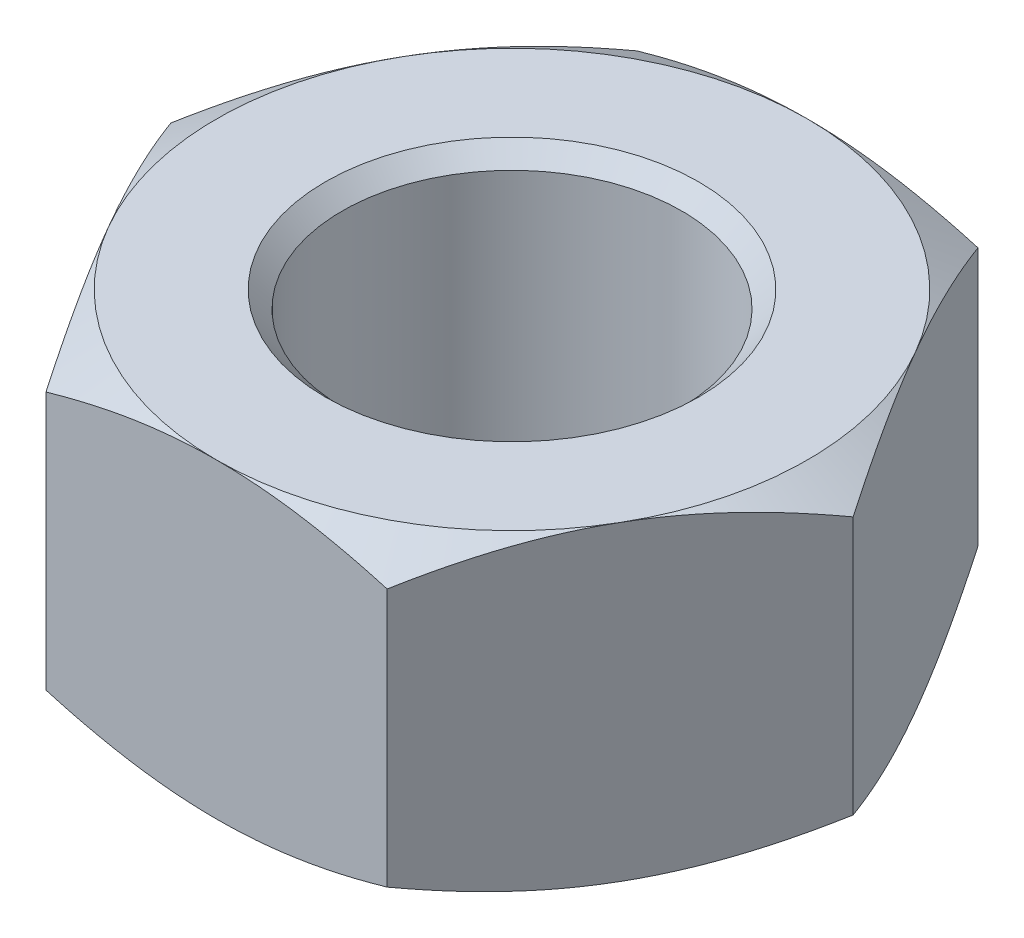
ISO-10303-21;
HEADER;
FILE_DESCRIPTION(('STEP AP214'),'2;1');
FILE_NAME('part.step','',(''),(''),'','','');
FILE_SCHEMA(('AUTOMOTIVE_DESIGN { 1 0 10303 214 1 1 1 1 }'));
ENDSEC;
DATA;
#1=APPLICATION_CONTEXT('core data for automotive mechanical design processes');
#2=APPLICATION_PROTOCOL_DEFINITION('international standard','automotive_design',2000,#1);
#3=PRODUCT_CONTEXT('',#1,'mechanical');
#4=PRODUCT('Part','Part','',(#3));
#5=PRODUCT_RELATED_PRODUCT_CATEGORY('part','',(#4));
#6=PRODUCT_DEFINITION_FORMATION('','',#4);
#7=PRODUCT_DEFINITION_CONTEXT('part definition',#1,'design');
#8=PRODUCT_DEFINITION('design','',#6,#7);
#9=PRODUCT_DEFINITION_SHAPE('','',#8);
#10=(LENGTH_UNIT() NAMED_UNIT(*) SI_UNIT(.MILLI.,.METRE.));
#11=(NAMED_UNIT(*) PLANE_ANGLE_UNIT() SI_UNIT($,.RADIAN.));
#12=(NAMED_UNIT(*) SI_UNIT($,.STERADIAN.) SOLID_ANGLE_UNIT());
#13=UNCERTAINTY_MEASURE_WITH_UNIT(LENGTH_MEASURE(1.E-05),#10,'distance_accuracy_value','');
#14=(GEOMETRIC_REPRESENTATION_CONTEXT(3) GLOBAL_UNCERTAINTY_ASSIGNED_CONTEXT((#13)) GLOBAL_UNIT_ASSIGNED_CONTEXT((#10,
#11,#12)) REPRESENTATION_CONTEXT('',''));
#15=CARTESIAN_POINT('',(0.,0.,0.));
#16=DIRECTION('',(0.,0.,1.));
#17=DIRECTION('',(1.,0.,0.));
#18=AXIS2_PLACEMENT_3D('',#15,#16,#17);
#19=CARTESIAN_POINT('',(55.2272413359522,-29.,-4.75));
#20=DIRECTION('',(0.866025403784439,0.,-0.5));
#21=DIRECTION('',(-0.5,0.,-0.866025403784439));
#22=AXIS2_PLACEMENT_3D('',#19,#20,#21);
#23=PLANE('',#22);
#24=CARTESIAN_POINT('',(52.4819837774524,-27.1498517286183,-9.50492557118405));
#25=CARTESIAN_POINT('',(53.9533399166947,-28.,-6.95646198198795));
#26=CARTESIAN_POINT('',(55.2272413359522,-28.,-4.75));
#27=CARTESIAN_POINT('',(56.5011427552097,-28.,-2.54353801801205));
#28=CARTESIAN_POINT('',(57.9724988944519,-27.1498517286183,0.00492557118405202));
#29=(BOUNDED_CURVE() B_SPLINE_CURVE(2,(#24,#25,#26,#27,#28),.UNSPECIFIED.,.F.,
.F.) B_SPLINE_CURVE_WITH_KNOTS((3,2,3),(0.,5.57015057763849,11.140301155277),
.UNSPECIFIED.) CURVE() GEOMETRIC_REPRESENTATION_ITEM() RATIONAL_B_SPLINE_CURVE((1.,
1.03802697460132,1.,1.03802697460132,1.)) REPRESENTATION_ITEM(''));
#30=CARTESIAN_POINT('',(52.4848275573015,-27.1514942239681,-9.5));
#31=VERTEX_POINT('',#30);
#32=CARTESIAN_POINT('',(55.2272413359522,-28.,-4.75));
#33=VERTEX_POINT('',#32);
#34=EDGE_CURVE('E126',#31,#33,#29,.T.);
#35=ORIENTED_EDGE('',*,*,#34,.F.);
#36=DIRECTION('',(0.,1.,0.));
#37=VECTOR('',#36,1.);
#38=CARTESIAN_POINT('',(52.4848275573015,-29.,-9.5));
#39=LINE('',#38,#37);
#40=CARTESIAN_POINT('',(52.4848275573015,-18.8485057760319,-9.5));
#41=VERTEX_POINT('',#40);
#42=EDGE_CURVE('E11',#31,#41,#39,.T.);
#43=ORIENTED_EDGE('',*,*,#42,.T.);
#44=CARTESIAN_POINT('',(57.9724988944519,-18.8501482713817,0.00492557118405869));
#45=CARTESIAN_POINT('',(56.5011427552096,-18.,-2.54353801801204));
#46=CARTESIAN_POINT('',(55.2272413359522,-18.,-4.75));
#47=CARTESIAN_POINT('',(53.9533399166948,-18.,-6.95646198198795));
#48=CARTESIAN_POINT('',(52.4819837774524,-18.8501482713817,-9.50492557118406));
#49=(BOUNDED_CURVE() B_SPLINE_CURVE(2,(#44,#45,#46,#47,#48),.UNSPECIFIED.,.F.,
.F.) B_SPLINE_CURVE_WITH_KNOTS((3,2,3),(0.,5.57015057763849,11.140301155277),
.UNSPECIFIED.) CURVE() GEOMETRIC_REPRESENTATION_ITEM() RATIONAL_B_SPLINE_CURVE((1.,
1.03802697460132,1.,1.03802697460132,1.)) REPRESENTATION_ITEM(''));
#50=CARTESIAN_POINT('',(55.2272413359522,-18.,-4.75));
#51=VERTEX_POINT('',#50);
#52=EDGE_CURVE('E223',#51,#41,#49,.T.);
#53=ORIENTED_EDGE('',*,*,#52,.F.);
#54=CARTESIAN_POINT('',(57.9724988944519,-18.8501482713817,0.00492557118405869));
#55=CARTESIAN_POINT('',(56.5011427552096,-18.,-2.54353801801204));
#56=CARTESIAN_POINT('',(55.2272413359522,-18.,-4.75));
#57=CARTESIAN_POINT('',(53.9533399166948,-18.,-6.95646198198795));
#58=CARTESIAN_POINT('',(52.4819837774524,-18.8501482713817,-9.50492557118406));
#59=(BOUNDED_CURVE() B_SPLINE_CURVE(2,(#54,#55,#56,#57,#58),.UNSPECIFIED.,.F.,
.F.) B_SPLINE_CURVE_WITH_KNOTS((3,2,3),(0.,5.57015057763849,11.140301155277),
.UNSPECIFIED.) CURVE() GEOMETRIC_REPRESENTATION_ITEM() RATIONAL_B_SPLINE_CURVE((1.,
1.03802697460132,1.,1.03802697460132,1.)) REPRESENTATION_ITEM(''));
#60=CARTESIAN_POINT('',(57.9696551146029,-18.8485057760319,0.));
#61=VERTEX_POINT('',#60);
#62=EDGE_CURVE('E175',#61,#51,#59,.T.);
#63=ORIENTED_EDGE('',*,*,#62,.F.);
#64=DIRECTION('',(0.,1.,0.));
#65=VECTOR('',#64,1.);
#66=CARTESIAN_POINT('',(57.9696551146029,-29.,0.));
#67=LINE('',#66,#65);
#68=CARTESIAN_POINT('',(57.9696551146029,-27.1514942239681,0.));
#69=VERTEX_POINT('',#68);
#70=EDGE_CURVE('E129',#69,#61,#67,.T.);
#71=ORIENTED_EDGE('',*,*,#70,.F.);
#72=CARTESIAN_POINT('',(52.4819837774524,-27.1498517286183,-9.50492557118405));
#73=CARTESIAN_POINT('',(53.9533399166947,-28.,-6.95646198198795));
#74=CARTESIAN_POINT('',(55.2272413359522,-28.,-4.75));
#75=CARTESIAN_POINT('',(56.5011427552097,-28.,-2.54353801801205));
#76=CARTESIAN_POINT('',(57.9724988944519,-27.1498517286183,0.00492557118405202));
#77=(BOUNDED_CURVE() B_SPLINE_CURVE(2,(#72,#73,#74,#75,#76),.UNSPECIFIED.,.F.,
.F.) B_SPLINE_CURVE_WITH_KNOTS((3,2,3),(0.,5.57015057763849,11.140301155277),
.UNSPECIFIED.) CURVE() GEOMETRIC_REPRESENTATION_ITEM() RATIONAL_B_SPLINE_CURVE((1.,
1.03802697460132,1.,1.03802697460132,1.)) REPRESENTATION_ITEM(''));
#78=EDGE_CURVE('E114',#33,#69,#77,.T.);
#79=ORIENTED_EDGE('',*,*,#78,.F.);
#80=EDGE_LOOP('',(#35,#43,#53,#63,#71,#79));
#81=FACE_BOUND('',#80,.T.);
#82=ADVANCED_FACE('F16',(#81),#23,.T.);
#83=CARTESIAN_POINT('',(47.,-29.,-9.5));
#84=DIRECTION('',(0.,0.,-1.));
#85=DIRECTION('',(-1.,0.,0.));
#86=AXIS2_PLACEMENT_3D('',#83,#84,#85);
#87=PLANE('',#86);
#88=CARTESIAN_POINT('',(41.5094848830005,-27.1498517286183,-9.5));
#89=CARTESIAN_POINT('',(44.4521971614852,-28.,-9.50000000000001));
#90=CARTESIAN_POINT('',(47.,-28.,-9.5));
#91=CARTESIAN_POINT('',(49.5478028385149,-28.,-9.50000000000001));
#92=CARTESIAN_POINT('',(52.4905151169995,-27.1498517286183,-9.5));
#93=(BOUNDED_CURVE() B_SPLINE_CURVE(2,(#88,#89,#90,#91,#92),.UNSPECIFIED.,.F.,
.F.) B_SPLINE_CURVE_WITH_KNOTS((3,2,3),(0.,5.57015057763849,11.140301155277),
.UNSPECIFIED.) CURVE() GEOMETRIC_REPRESENTATION_ITEM() RATIONAL_B_SPLINE_CURVE((1.,
1.03802697460134,1.,1.03802697460134,1.)) REPRESENTATION_ITEM(''));
#94=CARTESIAN_POINT('',(41.5151724426986,-27.1514942239681,-9.5));
#95=VERTEX_POINT('',#94);
#96=CARTESIAN_POINT('',(47.,-28.,-9.5));
#97=VERTEX_POINT('',#96);
#98=EDGE_CURVE('E222',#95,#97,#93,.T.);
#99=ORIENTED_EDGE('',*,*,#98,.F.);
#100=DIRECTION('',(0.,1.,0.));
#101=VECTOR('',#100,1.);
#102=CARTESIAN_POINT('',(41.5151724426986,-29.,-9.5));
#103=LINE('',#102,#101);
#104=CARTESIAN_POINT('',(41.5151724426986,-18.8485057760319,-9.5));
#105=VERTEX_POINT('',#104);
#106=EDGE_CURVE('E28',#95,#105,#103,.T.);
#107=ORIENTED_EDGE('',*,*,#106,.T.);
#108=CARTESIAN_POINT('',(52.4905151169995,-18.8501482713817,-9.5));
#109=CARTESIAN_POINT('',(49.5478028385149,-18.,-9.50000000000001));
#110=CARTESIAN_POINT('',(47.,-18.,-9.5));
#111=CARTESIAN_POINT('',(44.4521971614851,-18.,-9.50000000000001));
#112=CARTESIAN_POINT('',(41.5094848830005,-18.8501482713817,-9.5));
#113=(BOUNDED_CURVE() B_SPLINE_CURVE(2,(#108,#109,#110,#111,#112),.UNSPECIFIED.,.F.,
.F.) B_SPLINE_CURVE_WITH_KNOTS((3,2,3),(0.,5.5701505776385,11.140301155277),
.UNSPECIFIED.) CURVE() GEOMETRIC_REPRESENTATION_ITEM() RATIONAL_B_SPLINE_CURVE((1.,
1.03802697460132,1.,1.03802697460132,1.)) REPRESENTATION_ITEM(''));
#114=CARTESIAN_POINT('',(47.,-18.,-9.5));
#115=VERTEX_POINT('',#114);
#116=EDGE_CURVE('E253',#115,#105,#113,.T.);
#117=ORIENTED_EDGE('',*,*,#116,.F.);
#118=CARTESIAN_POINT('',(52.4905151169995,-18.8501482713817,-9.5));
#119=CARTESIAN_POINT('',(49.5478028385149,-18.,-9.50000000000001));
#120=CARTESIAN_POINT('',(47.,-18.,-9.5));
#121=CARTESIAN_POINT('',(44.4521971614851,-18.,-9.50000000000001));
#122=CARTESIAN_POINT('',(41.5094848830005,-18.8501482713817,-9.5));
#123=(BOUNDED_CURVE() B_SPLINE_CURVE(2,(#118,#119,#120,#121,#122),.UNSPECIFIED.,.F.,
.F.) B_SPLINE_CURVE_WITH_KNOTS((3,2,3),(0.,5.5701505776385,11.140301155277),
.UNSPECIFIED.) CURVE() GEOMETRIC_REPRESENTATION_ITEM() RATIONAL_B_SPLINE_CURVE((1.,
1.03802697460132,1.,1.03802697460132,1.)) REPRESENTATION_ITEM(''));
#124=EDGE_CURVE('E20',#41,#115,#123,.T.);
#125=ORIENTED_EDGE('',*,*,#124,.F.);
#126=ORIENTED_EDGE('',*,*,#42,.F.);
#127=CARTESIAN_POINT('',(41.5094848830005,-27.1498517286183,-9.5));
#128=CARTESIAN_POINT('',(44.4521971614852,-28.,-9.50000000000001));
#129=CARTESIAN_POINT('',(47.,-28.,-9.5));
#130=CARTESIAN_POINT('',(49.5478028385149,-28.,-9.50000000000001));
#131=CARTESIAN_POINT('',(52.4905151169995,-27.1498517286183,-9.5));
#132=(BOUNDED_CURVE() B_SPLINE_CURVE(2,(#127,#128,#129,#130,#131),.UNSPECIFIED.,.F.,
.F.) B_SPLINE_CURVE_WITH_KNOTS((3,2,3),(0.,5.57015057763849,11.140301155277),
.UNSPECIFIED.) CURVE() GEOMETRIC_REPRESENTATION_ITEM() RATIONAL_B_SPLINE_CURVE((1.,
1.03802697460134,1.,1.03802697460134,1.)) REPRESENTATION_ITEM(''));
#133=EDGE_CURVE('E141',#97,#31,#132,.T.);
#134=ORIENTED_EDGE('',*,*,#133,.F.);
#135=EDGE_LOOP('',(#99,#107,#117,#125,#126,#134));
#136=FACE_BOUND('',#135,.T.);
#137=ADVANCED_FACE('F383',(#136),#87,.T.);
#138=CARTESIAN_POINT('',(38.7727586640478,-29.,-4.75));
#139=DIRECTION('',(-0.866025403784439,0.,-0.5));
#140=DIRECTION('',(-0.5,0.,0.866025403784439));
#141=AXIS2_PLACEMENT_3D('',#138,#139,#140);
#142=PLANE('',#141);
#143=CARTESIAN_POINT('',(36.0275011055481,-27.1498517286183,0.00492557118405107));
#144=CARTESIAN_POINT('',(37.4988572447905,-28.,-2.54353801801205));
#145=CARTESIAN_POINT('',(38.7727586640478,-28.,-4.75));
#146=CARTESIAN_POINT('',(40.0466600833053,-28.,-6.95646198198796));
#147=CARTESIAN_POINT('',(41.5180162225476,-27.1498517286183,-9.50492557118406));
#148=(BOUNDED_CURVE() B_SPLINE_CURVE(2,(#143,#144,#145,#146,#147),.UNSPECIFIED.,.F.,
.F.) B_SPLINE_CURVE_WITH_KNOTS((3,2,3),(0.,5.57015057763849,11.140301155277),
.UNSPECIFIED.) CURVE() GEOMETRIC_REPRESENTATION_ITEM() RATIONAL_B_SPLINE_CURVE((1.,
1.03802697460134,1.,1.03802697460135,1.)) REPRESENTATION_ITEM(''));
#149=CARTESIAN_POINT('',(36.0303448853971,-27.1514942239681,0.));
#150=VERTEX_POINT('',#149);
#151=CARTESIAN_POINT('',(38.7727586640478,-28.,-4.75));
#152=VERTEX_POINT('',#151);
#153=EDGE_CURVE('E148',#150,#152,#148,.T.);
#154=ORIENTED_EDGE('',*,*,#153,.F.);
#155=DIRECTION('',(0.,1.,0.));
#156=VECTOR('',#155,1.);
#157=CARTESIAN_POINT('',(36.0303448853971,-29.,0.));
#158=LINE('',#157,#156);
#159=CARTESIAN_POINT('',(36.0303448853971,-18.8485057760319,0.));
#160=VERTEX_POINT('',#159);
#161=EDGE_CURVE('E194',#150,#160,#158,.T.);
#162=ORIENTED_EDGE('',*,*,#161,.T.);
#163=CARTESIAN_POINT('',(41.5180162225476,-18.8501482713817,-9.50492557118407));
#164=CARTESIAN_POINT('',(40.0466600833053,-18.,-6.95646198198798));
#165=CARTESIAN_POINT('',(38.7727586640478,-18.,-4.75));
#166=CARTESIAN_POINT('',(37.4988572447904,-18.,-2.54353801801203));
#167=CARTESIAN_POINT('',(36.0275011055481,-18.8501482713817,0.00492557118405964));
#168=(BOUNDED_CURVE() B_SPLINE_CURVE(2,(#163,#164,#165,#166,#167),.UNSPECIFIED.,.F.,
.F.) B_SPLINE_CURVE_WITH_KNOTS((3,2,3),(0.,5.5701505776385,11.140301155277),
.UNSPECIFIED.) CURVE() GEOMETRIC_REPRESENTATION_ITEM() RATIONAL_B_SPLINE_CURVE((1.,
1.03802697460132,1.,1.03802697460132,1.)) REPRESENTATION_ITEM(''));
#169=CARTESIAN_POINT('',(38.7727586640478,-18.,-4.75));
#170=VERTEX_POINT('',#169);
#171=EDGE_CURVE('E168',#170,#160,#168,.T.);
#172=ORIENTED_EDGE('',*,*,#171,.F.);
#173=CARTESIAN_POINT('',(41.5180162225476,-18.8501482713817,-9.50492557118407));
#174=CARTESIAN_POINT('',(40.0466600833053,-18.,-6.95646198198798));
#175=CARTESIAN_POINT('',(38.7727586640478,-18.,-4.75));
#176=CARTESIAN_POINT('',(37.4988572447904,-18.,-2.54353801801203));
#177=CARTESIAN_POINT('',(36.0275011055481,-18.8501482713817,0.00492557118405964));
#178=(BOUNDED_CURVE() B_SPLINE_CURVE(2,(#173,#174,#175,#176,#177),.UNSPECIFIED.,.F.,
.F.) B_SPLINE_CURVE_WITH_KNOTS((3,2,3),(0.,5.5701505776385,11.140301155277),
.UNSPECIFIED.) CURVE() GEOMETRIC_REPRESENTATION_ITEM() RATIONAL_B_SPLINE_CURVE((1.,
1.03802697460132,1.,1.03802697460132,1.)) REPRESENTATION_ITEM(''));
#179=EDGE_CURVE('E121',#105,#170,#178,.T.);
#180=ORIENTED_EDGE('',*,*,#179,.F.);
#181=ORIENTED_EDGE('',*,*,#106,.F.);
#182=CARTESIAN_POINT('',(36.0275011055481,-27.1498517286183,0.00492557118405107));
#183=CARTESIAN_POINT('',(37.4988572447905,-28.,-2.54353801801205));
#184=CARTESIAN_POINT('',(38.7727586640478,-28.,-4.75));
#185=CARTESIAN_POINT('',(40.0466600833053,-28.,-6.95646198198796));
#186=CARTESIAN_POINT('',(41.5180162225476,-27.1498517286183,-9.50492557118406));
#187=(BOUNDED_CURVE() B_SPLINE_CURVE(2,(#182,#183,#184,#185,#186),.UNSPECIFIED.,.F.,
.F.) B_SPLINE_CURVE_WITH_KNOTS((3,2,3),(0.,5.57015057763849,11.140301155277),
.UNSPECIFIED.) CURVE() GEOMETRIC_REPRESENTATION_ITEM() RATIONAL_B_SPLINE_CURVE((1.,
1.03802697460134,1.,1.03802697460135,1.)) REPRESENTATION_ITEM(''));
#188=EDGE_CURVE('E301',#152,#95,#187,.T.);
#189=ORIENTED_EDGE('',*,*,#188,.F.);
#190=EDGE_LOOP('',(#154,#162,#172,#180,#181,#189));
#191=FACE_BOUND('',#190,.T.);
#192=ADVANCED_FACE('F366',(#191),#142,.T.);
#193=CARTESIAN_POINT('',(55.2272413359522,-29.,4.75));
#194=DIRECTION('',(0.866025403784439,0.,0.5));
#195=DIRECTION('',(0.5,0.,-0.866025403784439));
#196=AXIS2_PLACEMENT_3D('',#193,#194,#195);
#197=PLANE('',#196);
#198=CARTESIAN_POINT('',(57.9724988944519,-27.1498517286183,-0.00492557118405583));
#199=CARTESIAN_POINT('',(56.5011427552096,-28.,2.54353801801203));
#200=CARTESIAN_POINT('',(55.2272413359522,-28.,4.75));
#201=CARTESIAN_POINT('',(53.9533399166947,-28.,6.95646198198796));
#202=CARTESIAN_POINT('',(52.4819837774524,-27.1498517286183,9.50492557118405));
#203=(BOUNDED_CURVE() B_SPLINE_CURVE(2,(#198,#199,#200,#201,#202),.UNSPECIFIED.,.F.,
.F.) B_SPLINE_CURVE_WITH_KNOTS((3,2,3),(0.,5.57015057763849,11.140301155277),
.UNSPECIFIED.) CURVE() GEOMETRIC_REPRESENTATION_ITEM() RATIONAL_B_SPLINE_CURVE((1.,
1.03802697460133,1.,1.03802697460135,1.)) REPRESENTATION_ITEM(''));
#204=CARTESIAN_POINT('',(55.2272413359522,-28.,4.75));
#205=VERTEX_POINT('',#204);
#206=CARTESIAN_POINT('',(52.4848275573015,-27.1514942239681,9.5));
#207=VERTEX_POINT('',#206);
#208=EDGE_CURVE('E189',#205,#207,#203,.T.);
#209=ORIENTED_EDGE('',*,*,#208,.F.);
#210=CARTESIAN_POINT('',(57.9724988944519,-27.1498517286183,-0.00492557118405583));
#211=CARTESIAN_POINT('',(56.5011427552096,-28.,2.54353801801203));
#212=CARTESIAN_POINT('',(55.2272413359522,-28.,4.75));
#213=CARTESIAN_POINT('',(53.9533399166947,-28.,6.95646198198796));
#214=CARTESIAN_POINT('',(52.4819837774524,-27.1498517286183,9.50492557118405));
#215=(BOUNDED_CURVE() B_SPLINE_CURVE(2,(#210,#211,#212,#213,#214),.UNSPECIFIED.,.F.,
.F.) B_SPLINE_CURVE_WITH_KNOTS((3,2,3),(0.,5.57015057763849,11.140301155277),
.UNSPECIFIED.) CURVE() GEOMETRIC_REPRESENTATION_ITEM() RATIONAL_B_SPLINE_CURVE((1.,
1.03802697460133,1.,1.03802697460135,1.)) REPRESENTATION_ITEM(''));
#216=EDGE_CURVE('E116',#69,#205,#215,.T.);
#217=ORIENTED_EDGE('',*,*,#216,.F.);
#218=ORIENTED_EDGE('',*,*,#70,.T.);
#219=CARTESIAN_POINT('',(52.4819837774524,-18.8501482713817,9.50492557118406));
#220=CARTESIAN_POINT('',(53.9533399166947,-18.,6.95646198198797));
#221=CARTESIAN_POINT('',(55.2272413359522,-18.,4.75));
#222=CARTESIAN_POINT('',(56.5011427552096,-18.,2.54353801801203));
#223=CARTESIAN_POINT('',(57.9724988944519,-18.8501482713817,-0.00492557118406345));
#224=(BOUNDED_CURVE() B_SPLINE_CURVE(2,(#219,#220,#221,#222,#223),.UNSPECIFIED.,.F.,
.F.) B_SPLINE_CURVE_WITH_KNOTS((3,2,3),(0.,5.5701505776385,11.140301155277),
.UNSPECIFIED.) CURVE() GEOMETRIC_REPRESENTATION_ITEM() RATIONAL_B_SPLINE_CURVE((1.,
1.03802697460133,1.,1.03802697460134,1.)) REPRESENTATION_ITEM(''));
#225=CARTESIAN_POINT('',(55.2272413359522,-18.,4.75));
#226=VERTEX_POINT('',#225);
#227=EDGE_CURVE('E170',#226,#61,#224,.T.);
#228=ORIENTED_EDGE('',*,*,#227,.F.);
#229=CARTESIAN_POINT('',(52.4819837774524,-18.8501482713817,9.50492557118406));
#230=CARTESIAN_POINT('',(53.9533399166947,-18.,6.95646198198797));
#231=CARTESIAN_POINT('',(55.2272413359522,-18.,4.75));
#232=CARTESIAN_POINT('',(56.5011427552096,-18.,2.54353801801203));
#233=CARTESIAN_POINT('',(57.9724988944519,-18.8501482713817,-0.00492557118406345));
#234=(BOUNDED_CURVE() B_SPLINE_CURVE(2,(#229,#230,#231,#232,#233),.UNSPECIFIED.,.F.,
.F.) B_SPLINE_CURVE_WITH_KNOTS((3,2,3),(0.,5.5701505776385,11.140301155277),
.UNSPECIFIED.) CURVE() GEOMETRIC_REPRESENTATION_ITEM() RATIONAL_B_SPLINE_CURVE((1.,
1.03802697460133,1.,1.03802697460134,1.)) REPRESENTATION_ITEM(''));
#235=CARTESIAN_POINT('',(52.4848275573015,-18.8485057760319,9.5));
#236=VERTEX_POINT('',#235);
#237=EDGE_CURVE('E215',#236,#226,#234,.T.);
#238=ORIENTED_EDGE('',*,*,#237,.F.);
#239=DIRECTION('',(0.,1.,0.));
#240=VECTOR('',#239,1.);
#241=CARTESIAN_POINT('',(52.4848275573015,-29.,9.5));
#242=LINE('',#241,#240);
#243=EDGE_CURVE('E236',#207,#236,#242,.T.);
#244=ORIENTED_EDGE('',*,*,#243,.F.);
#245=EDGE_LOOP('',(#209,#217,#218,#228,#238,#244));
#246=FACE_BOUND('',#245,.T.);
#247=ADVANCED_FACE('F396',(#246),#197,.T.);
#248=CARTESIAN_POINT('',(47.,-29.,9.5));
#249=DIRECTION('',(0.,0.,1.));
#250=DIRECTION('',(1.,0.,0.));
#251=AXIS2_PLACEMENT_3D('',#248,#249,#250);
#252=PLANE('',#251);
#253=CARTESIAN_POINT('',(52.4905151169995,-27.1498517286183,9.5));
#254=CARTESIAN_POINT('',(49.5478028385149,-28.,9.5));
#255=CARTESIAN_POINT('',(47.,-28.,9.5));
#256=CARTESIAN_POINT('',(44.4521971614851,-28.,9.49999999999999));
#257=CARTESIAN_POINT('',(41.5094848830005,-27.1498517286183,9.5));
#258=(BOUNDED_CURVE() B_SPLINE_CURVE(2,(#253,#254,#255,#256,#257),.UNSPECIFIED.,.F.,
.F.) B_SPLINE_CURVE_WITH_KNOTS((3,2,3),(0.,5.5701505776385,11.140301155277),
.UNSPECIFIED.) CURVE() GEOMETRIC_REPRESENTATION_ITEM() RATIONAL_B_SPLINE_CURVE((1.,
1.03802697460134,1.,1.03802697460134,1.)) REPRESENTATION_ITEM(''));
#259=CARTESIAN_POINT('',(47.,-28.,9.5));
#260=VERTEX_POINT('',#259);
#261=CARTESIAN_POINT('',(41.5151724426986,-27.1514942239681,9.5));
#262=VERTEX_POINT('',#261);
#263=EDGE_CURVE('E285',#260,#262,#258,.T.);
#264=ORIENTED_EDGE('',*,*,#263,.F.);
#265=CARTESIAN_POINT('',(52.4905151169995,-27.1498517286183,9.5));
#266=CARTESIAN_POINT('',(49.5478028385149,-28.,9.5));
#267=CARTESIAN_POINT('',(47.,-28.,9.5));
#268=CARTESIAN_POINT('',(44.4521971614851,-28.,9.49999999999999));
#269=CARTESIAN_POINT('',(41.5094848830005,-27.1498517286183,9.5));
#270=(BOUNDED_CURVE() B_SPLINE_CURVE(2,(#265,#266,#267,#268,#269),.UNSPECIFIED.,.F.,
.F.) B_SPLINE_CURVE_WITH_KNOTS((3,2,3),(0.,5.5701505776385,11.140301155277),
.UNSPECIFIED.) CURVE() GEOMETRIC_REPRESENTATION_ITEM() RATIONAL_B_SPLINE_CURVE((1.,
1.03802697460134,1.,1.03802697460134,1.)) REPRESENTATION_ITEM(''));
#271=EDGE_CURVE('E195',#207,#260,#270,.T.);
#272=ORIENTED_EDGE('',*,*,#271,.F.);
#273=ORIENTED_EDGE('',*,*,#243,.T.);
#274=CARTESIAN_POINT('',(41.5094848830005,-18.8501482713817,9.5));
#275=CARTESIAN_POINT('',(44.4521971614851,-18.,9.5));
#276=CARTESIAN_POINT('',(47.,-18.,9.5));
#277=CARTESIAN_POINT('',(49.5478028385148,-18.,9.5));
#278=CARTESIAN_POINT('',(52.4905151169995,-18.8501482713817,9.5));
#279=(BOUNDED_CURVE() B_SPLINE_CURVE(2,(#274,#275,#276,#277,#278),.UNSPECIFIED.,.F.,
.F.) B_SPLINE_CURVE_WITH_KNOTS((3,2,3),(0.,5.5701505776385,11.140301155277),
.UNSPECIFIED.) CURVE() GEOMETRIC_REPRESENTATION_ITEM() RATIONAL_B_SPLINE_CURVE((1.,
1.03802697460136,1.,1.03802697460136,1.)) REPRESENTATION_ITEM(''));
#280=CARTESIAN_POINT('',(47.,-18.,9.5));
#281=VERTEX_POINT('',#280);
#282=EDGE_CURVE('E160',#281,#236,#279,.T.);
#283=ORIENTED_EDGE('',*,*,#282,.F.);
#284=CARTESIAN_POINT('',(41.5094848830005,-18.8501482713817,9.5));
#285=CARTESIAN_POINT('',(44.4521971614851,-18.,9.5));
#286=CARTESIAN_POINT('',(47.,-18.,9.5));
#287=CARTESIAN_POINT('',(49.5478028385148,-18.,9.5));
#288=CARTESIAN_POINT('',(52.4905151169995,-18.8501482713817,9.5));
#289=(BOUNDED_CURVE() B_SPLINE_CURVE(2,(#284,#285,#286,#287,#288),.UNSPECIFIED.,.F.,
.F.) B_SPLINE_CURVE_WITH_KNOTS((3,2,3),(0.,5.5701505776385,11.140301155277),
.UNSPECIFIED.) CURVE() GEOMETRIC_REPRESENTATION_ITEM() RATIONAL_B_SPLINE_CURVE((1.,
1.03802697460136,1.,1.03802697460136,1.)) REPRESENTATION_ITEM(''));
#290=CARTESIAN_POINT('',(41.5151724426986,-18.8485057760319,9.5));
#291=VERTEX_POINT('',#290);
#292=EDGE_CURVE('E238',#291,#281,#289,.T.);
#293=ORIENTED_EDGE('',*,*,#292,.F.);
#294=DIRECTION('',(0.,1.,0.));
#295=VECTOR('',#294,1.);
#296=CARTESIAN_POINT('',(41.5151724426986,-29.,9.5));
#297=LINE('',#296,#295);
#298=EDGE_CURVE('E181',#262,#291,#297,.T.);
#299=ORIENTED_EDGE('',*,*,#298,.F.);
#300=EDGE_LOOP('',(#264,#272,#273,#283,#293,#299));
#301=FACE_BOUND('',#300,.T.);
#302=ADVANCED_FACE('F402',(#301),#252,.T.);
#303=CARTESIAN_POINT('',(38.7727586640478,-29.,4.75));
#304=DIRECTION('',(-0.866025403784439,0.,0.5));
#305=DIRECTION('',(0.5,0.,0.866025403784439));
#306=AXIS2_PLACEMENT_3D('',#303,#304,#305);
#307=PLANE('',#306);
#308=CARTESIAN_POINT('',(41.5180162225476,-27.1498517286183,9.50492557118405));
#309=CARTESIAN_POINT('',(40.0466600833053,-28.,6.95646198198795));
#310=CARTESIAN_POINT('',(38.7727586640478,-28.,4.75));
#311=CARTESIAN_POINT('',(37.4988572447904,-28.,2.54353801801204));
#312=CARTESIAN_POINT('',(36.0275011055481,-27.1498517286183,-0.00492557118405964));
#313=(BOUNDED_CURVE() B_SPLINE_CURVE(2,(#308,#309,#310,#311,#312),.UNSPECIFIED.,.F.,
.F.) B_SPLINE_CURVE_WITH_KNOTS((3,2,3),(0.,5.57015057763849,11.140301155277),
.UNSPECIFIED.) CURVE() GEOMETRIC_REPRESENTATION_ITEM() RATIONAL_B_SPLINE_CURVE((1.,
1.03802697460133,1.,1.03802697460134,1.)) REPRESENTATION_ITEM(''));
#314=CARTESIAN_POINT('',(38.7727586640478,-28.,4.75));
#315=VERTEX_POINT('',#314);
#316=EDGE_CURVE('E293',#315,#150,#313,.T.);
#317=ORIENTED_EDGE('',*,*,#316,.F.);
#318=CARTESIAN_POINT('',(41.5180162225476,-27.1498517286183,9.50492557118405));
#319=CARTESIAN_POINT('',(40.0466600833053,-28.,6.95646198198795));
#320=CARTESIAN_POINT('',(38.7727586640478,-28.,4.75));
#321=CARTESIAN_POINT('',(37.4988572447904,-28.,2.54353801801204));
#322=CARTESIAN_POINT('',(36.0275011055481,-27.1498517286183,-0.00492557118405964));
#323=(BOUNDED_CURVE() B_SPLINE_CURVE(2,(#318,#319,#320,#321,#322),.UNSPECIFIED.,.F.,
.F.) B_SPLINE_CURVE_WITH_KNOTS((3,2,3),(0.,5.57015057763849,11.140301155277),
.UNSPECIFIED.) CURVE() GEOMETRIC_REPRESENTATION_ITEM() RATIONAL_B_SPLINE_CURVE((1.,
1.03802697460133,1.,1.03802697460134,1.)) REPRESENTATION_ITEM(''));
#324=EDGE_CURVE('E183',#262,#315,#323,.T.);
#325=ORIENTED_EDGE('',*,*,#324,.F.);
#326=ORIENTED_EDGE('',*,*,#298,.T.);
#327=CARTESIAN_POINT('',(36.0275011055481,-18.8501482713817,-0.00492557118406345));
#328=CARTESIAN_POINT('',(37.4988572447904,-18.,2.54353801801203));
#329=CARTESIAN_POINT('',(38.7727586640478,-18.,4.75));
#330=CARTESIAN_POINT('',(40.0466600833052,-18.,6.95646198198796));
#331=CARTESIAN_POINT('',(41.5180162225476,-18.8501482713817,9.50492557118406));
#332=(BOUNDED_CURVE() B_SPLINE_CURVE(2,(#327,#328,#329,#330,#331),.UNSPECIFIED.,.F.,
.F.) B_SPLINE_CURVE_WITH_KNOTS((3,2,3),(0.,5.57015057763849,11.140301155277),
.UNSPECIFIED.) CURVE() GEOMETRIC_REPRESENTATION_ITEM() RATIONAL_B_SPLINE_CURVE((1.,
1.03802697460132,1.,1.03802697460134,1.)) REPRESENTATION_ITEM(''));
#333=CARTESIAN_POINT('',(38.7727586640478,-18.,4.75));
#334=VERTEX_POINT('',#333);
#335=EDGE_CURVE('E152',#334,#291,#332,.T.);
#336=ORIENTED_EDGE('',*,*,#335,.F.);
#337=CARTESIAN_POINT('',(36.0275011055481,-18.8501482713817,-0.00492557118406345));
#338=CARTESIAN_POINT('',(37.4988572447904,-18.,2.54353801801203));
#339=CARTESIAN_POINT('',(38.7727586640478,-18.,4.75));
#340=CARTESIAN_POINT('',(40.0466600833052,-18.,6.95646198198796));
#341=CARTESIAN_POINT('',(41.5180162225476,-18.8501482713817,9.50492557118406));
#342=(BOUNDED_CURVE() B_SPLINE_CURVE(2,(#337,#338,#339,#340,#341),.UNSPECIFIED.,.F.,
.F.) B_SPLINE_CURVE_WITH_KNOTS((3,2,3),(0.,5.57015057763849,11.140301155277),
.UNSPECIFIED.) CURVE() GEOMETRIC_REPRESENTATION_ITEM() RATIONAL_B_SPLINE_CURVE((1.,
1.03802697460132,1.,1.03802697460134,1.)) REPRESENTATION_ITEM(''));
#343=EDGE_CURVE('E169',#160,#334,#342,.T.);
#344=ORIENTED_EDGE('',*,*,#343,.F.);
#345=ORIENTED_EDGE('',*,*,#161,.F.);
#346=EDGE_LOOP('',(#317,#325,#326,#336,#344,#345));
#347=FACE_BOUND('',#346,.T.);
#348=ADVANCED_FACE('F373',(#347),#307,.T.);
#349=CARTESIAN_POINT('',(54.75,-28.,0.));
#350=DIRECTION('',(0.,-1.,0.));
#351=DIRECTION('',(-1.,0.,0.));
#352=AXIS2_PLACEMENT_3D('',#349,#350,#351);
#353=PLANE('',#352);
#354=CARTESIAN_POINT('',(47.,-28.,0.));
#355=DIRECTION('',(0.,1.,0.));
#356=DIRECTION('',(1.,0.,0.));
#357=AXIS2_PLACEMENT_3D('',#354,#355,#356);
#358=CIRCLE('',#357,6.);
#359=CARTESIAN_POINT('',(53.,-28.,0.));
#360=VERTEX_POINT('',#359);
#361=EDGE_CURVE('E34',#360,#360,#358,.T.);
#362=ORIENTED_EDGE('',*,*,#361,.T.);
#363=EDGE_LOOP('',(#362));
#364=FACE_BOUND('',#363,.T.);
#365=CARTESIAN_POINT('',(47.,-28.,0.));
#366=DIRECTION('',(0.,1.,0.));
#367=DIRECTION('',(1.,0.,0.));
#368=AXIS2_PLACEMENT_3D('',#365,#366,#367);
#369=CIRCLE('',#368,9.5);
#370=EDGE_CURVE('E111',#205,#33,#369,.T.);
#371=ORIENTED_EDGE('',*,*,#370,.F.);
#372=CARTESIAN_POINT('',(47.,-28.,0.));
#373=DIRECTION('',(0.,1.,0.));
#374=DIRECTION('',(1.,0.,0.));
#375=AXIS2_PLACEMENT_3D('',#372,#373,#374);
#376=CIRCLE('',#375,9.5);
#377=EDGE_CURVE('E199',#260,#205,#376,.T.);
#378=ORIENTED_EDGE('',*,*,#377,.F.);
#379=CARTESIAN_POINT('',(47.,-28.,0.));
#380=DIRECTION('',(0.,1.,0.));
#381=DIRECTION('',(1.,0.,0.));
#382=AXIS2_PLACEMENT_3D('',#379,#380,#381);
#383=CIRCLE('',#382,9.5);
#384=EDGE_CURVE('E188',#315,#260,#383,.T.);
#385=ORIENTED_EDGE('',*,*,#384,.F.);
#386=CARTESIAN_POINT('',(47.,-28.,0.));
#387=DIRECTION('',(0.,1.,0.));
#388=DIRECTION('',(1.,0.,0.));
#389=AXIS2_PLACEMENT_3D('',#386,#387,#388);
#390=CIRCLE('',#389,9.5);
#391=EDGE_CURVE('E302',#152,#315,#390,.T.);
#392=ORIENTED_EDGE('',*,*,#391,.F.);
#393=CARTESIAN_POINT('',(47.,-28.,0.));
#394=DIRECTION('',(0.,1.,0.));
#395=DIRECTION('',(1.,0.,0.));
#396=AXIS2_PLACEMENT_3D('',#393,#394,#395);
#397=CIRCLE('',#396,9.5);
#398=EDGE_CURVE('E135',#97,#152,#397,.T.);
#399=ORIENTED_EDGE('',*,*,#398,.F.);
#400=CARTESIAN_POINT('',(47.,-28.,0.));
#401=DIRECTION('',(0.,1.,0.));
#402=DIRECTION('',(1.,0.,0.));
#403=AXIS2_PLACEMENT_3D('',#400,#401,#402);
#404=CIRCLE('',#403,9.5);
#405=EDGE_CURVE('E130',#33,#97,#404,.T.);
#406=ORIENTED_EDGE('',*,*,#405,.F.);
#407=EDGE_LOOP('',(#371,#378,#385,#392,#399,#406));
#408=FACE_BOUND('',#407,.T.);
#409=ADVANCED_FACE('F133',(#364,#408),#353,.T.);
#410=CARTESIAN_POINT('',(47.,-27.729375,0.));
#411=DIRECTION('',(0.,-1.,0.));
#412=DIRECTION('',(1.,0.,0.));
#413=AXIS2_PLACEMENT_3D('',#410,#411,#412);
#414=CONICAL_SURFACE('',#413,5.729375,0.785398163397448);
#415=CARTESIAN_POINT('',(47.,-27.45875,0.));
#416=DIRECTION('',(0.,1.,0.));
#417=DIRECTION('',(1.,0.,0.));
#418=AXIS2_PLACEMENT_3D('',#415,#416,#417);
#419=CIRCLE('',#418,5.45875);
#420=CARTESIAN_POINT('',(52.45875,-27.45875,0.));
#421=VERTEX_POINT('',#420);
#422=EDGE_CURVE('E182',#421,#421,#419,.T.);
#423=ORIENTED_EDGE('',*,*,#422,.T.);
#424=EDGE_LOOP('',(#423));
#425=FACE_BOUND('',#424,.T.);
#426=ORIENTED_EDGE('',*,*,#361,.F.);
#427=EDGE_LOOP('',(#426));
#428=FACE_BOUND('',#427,.T.);
#429=ADVANCED_FACE('F456',(#425,#428),#414,.F.);
#430=CARTESIAN_POINT('',(47.,-23.,0.));
#431=DIRECTION('',(0.,-1.,0.));
#432=DIRECTION('',(1.,0.,0.));
#433=AXIS2_PLACEMENT_3D('',#430,#431,#432);
#434=CYLINDRICAL_SURFACE('',#433,5.45875);
#435=CARTESIAN_POINT('',(47.,-18.54125,0.));
#436=DIRECTION('',(0.,1.,0.));
#437=DIRECTION('',(1.,0.,0.));
#438=AXIS2_PLACEMENT_3D('',#435,#436,#437);
#439=CIRCLE('',#438,5.45875);
#440=CARTESIAN_POINT('',(52.45875,-18.54125,0.));
#441=VERTEX_POINT('',#440);
#442=EDGE_CURVE('E234',#441,#441,#439,.T.);
#443=ORIENTED_EDGE('',*,*,#442,.T.);
#444=EDGE_LOOP('',(#443));
#445=FACE_BOUND('',#444,.T.);
#446=ORIENTED_EDGE('',*,*,#422,.F.);
#447=EDGE_LOOP('',(#446));
#448=FACE_BOUND('',#447,.T.);
#449=ADVANCED_FACE('F18',(#445,#448),#434,.F.);
#450=CARTESIAN_POINT('',(47.,-18.270625,0.));
#451=DIRECTION('',(0.,1.,0.));
#452=DIRECTION('',(1.,0.,0.));
#453=AXIS2_PLACEMENT_3D('',#450,#451,#452);
#454=CONICAL_SURFACE('',#453,5.729375,0.785398163397448);
#455=CARTESIAN_POINT('',(47.,-18.,0.));
#456=DIRECTION('',(0.,1.,0.));
#457=DIRECTION('',(1.,0.,0.));
#458=AXIS2_PLACEMENT_3D('',#455,#456,#457);
#459=CIRCLE('',#458,6.);
#460=CARTESIAN_POINT('',(53.,-18.,0.));
#461=VERTEX_POINT('',#460);
#462=EDGE_CURVE('E229',#461,#461,#459,.T.);
#463=ORIENTED_EDGE('',*,*,#462,.T.);
#464=EDGE_LOOP('',(#463));
#465=FACE_BOUND('',#464,.T.);
#466=ORIENTED_EDGE('',*,*,#442,.F.);
#467=EDGE_LOOP('',(#466));
#468=FACE_BOUND('',#467,.T.);
#469=ADVANCED_FACE('F429',(#465,#468),#454,.F.);
#470=CARTESIAN_POINT('',(54.75,-18.,0.));
#471=DIRECTION('',(0.,1.,0.));
#472=DIRECTION('',(1.,0.,0.));
#473=AXIS2_PLACEMENT_3D('',#470,#471,#472);
#474=PLANE('',#473);
#475=CARTESIAN_POINT('',(47.,-18.,0.));
#476=DIRECTION('',(0.,1.,0.));
#477=DIRECTION('',(1.,0.,0.));
#478=AXIS2_PLACEMENT_3D('',#475,#476,#477);
#479=CIRCLE('',#478,9.5);
#480=EDGE_CURVE('E228',#226,#51,#479,.T.);
#481=ORIENTED_EDGE('',*,*,#480,.T.);
#482=CARTESIAN_POINT('',(47.,-18.,0.));
#483=DIRECTION('',(0.,1.,0.));
#484=DIRECTION('',(1.,0.,0.));
#485=AXIS2_PLACEMENT_3D('',#482,#483,#484);
#486=CIRCLE('',#485,9.5);
#487=EDGE_CURVE('E235',#51,#115,#486,.T.);
#488=ORIENTED_EDGE('',*,*,#487,.T.);
#489=CARTESIAN_POINT('',(47.,-18.,0.));
#490=DIRECTION('',(0.,1.,0.));
#491=DIRECTION('',(1.,0.,0.));
#492=AXIS2_PLACEMENT_3D('',#489,#490,#491);
#493=CIRCLE('',#492,9.5);
#494=EDGE_CURVE('E258',#115,#170,#493,.T.);
#495=ORIENTED_EDGE('',*,*,#494,.T.);
#496=CARTESIAN_POINT('',(47.,-18.,0.));
#497=DIRECTION('',(0.,1.,0.));
#498=DIRECTION('',(1.,0.,0.));
#499=AXIS2_PLACEMENT_3D('',#496,#497,#498);
#500=CIRCLE('',#499,9.5);
#501=EDGE_CURVE('E162',#170,#334,#500,.T.);
#502=ORIENTED_EDGE('',*,*,#501,.T.);
#503=CARTESIAN_POINT('',(47.,-18.,0.));
#504=DIRECTION('',(0.,1.,0.));
#505=DIRECTION('',(1.,0.,0.));
#506=AXIS2_PLACEMENT_3D('',#503,#504,#505);
#507=CIRCLE('',#506,9.5);
#508=EDGE_CURVE('E161',#334,#281,#507,.T.);
#509=ORIENTED_EDGE('',*,*,#508,.T.);
#510=CARTESIAN_POINT('',(47.,-18.,0.));
#511=DIRECTION('',(0.,1.,0.));
#512=DIRECTION('',(1.,0.,0.));
#513=AXIS2_PLACEMENT_3D('',#510,#511,#512);
#514=CIRCLE('',#513,9.5);
#515=EDGE_CURVE('E176',#281,#226,#514,.T.);
#516=ORIENTED_EDGE('',*,*,#515,.T.);
#517=EDGE_LOOP('',(#481,#488,#495,#502,#509,#516));
#518=FACE_BOUND('',#517,.T.);
#519=ORIENTED_EDGE('',*,*,#462,.F.);
#520=EDGE_LOOP('',(#519));
#521=FACE_BOUND('',#520,.T.);
#522=ADVANCED_FACE('F390',(#518,#521),#474,.T.);
#523=CARTESIAN_POINT('',(47.,-18.4250741356908,0.));
#524=DIRECTION('',(0.,-1.,0.));
#525=DIRECTION('',(1.,0.,0.));
#526=AXIS2_PLACEMENT_3D('',#523,#524,#525);
#527=CONICAL_SURFACE('',#526,10.23625,1.0471975511966);
#528=ORIENTED_EDGE('',*,*,#52,.T.);
#529=ORIENTED_EDGE('',*,*,#124,.T.);
#530=ORIENTED_EDGE('',*,*,#487,.F.);
#531=EDGE_LOOP('',(#528,#529,#530));
#532=FACE_BOUND('',#531,.T.);
#533=ADVANCED_FACE('F388',(#532),#527,.T.);
#534=CARTESIAN_POINT('',(47.,-18.4250741356908,0.));
#535=DIRECTION('',(0.,-1.,0.));
#536=DIRECTION('',(1.,0.,0.));
#537=AXIS2_PLACEMENT_3D('',#534,#535,#536);
#538=CONICAL_SURFACE('',#537,10.23625,1.0471975511966);
#539=ORIENTED_EDGE('',*,*,#227,.T.);
#540=ORIENTED_EDGE('',*,*,#62,.T.);
#541=ORIENTED_EDGE('',*,*,#480,.F.);
#542=EDGE_LOOP('',(#539,#540,#541));
#543=FACE_BOUND('',#542,.T.);
#544=ADVANCED_FACE('F394',(#543),#538,.T.);
#545=CARTESIAN_POINT('',(47.,-18.4250741356908,0.));
#546=DIRECTION('',(0.,-1.,0.));
#547=DIRECTION('',(1.,0.,0.));
#548=AXIS2_PLACEMENT_3D('',#545,#546,#547);
#549=CONICAL_SURFACE('',#548,10.23625,1.0471975511966);
#550=ORIENTED_EDGE('',*,*,#282,.T.);
#551=ORIENTED_EDGE('',*,*,#237,.T.);
#552=ORIENTED_EDGE('',*,*,#515,.F.);
#553=EDGE_LOOP('',(#550,#551,#552));
#554=FACE_BOUND('',#553,.T.);
#555=ADVANCED_FACE('F399',(#554),#549,.T.);
#556=CARTESIAN_POINT('',(47.,-18.4250741356908,0.));
#557=DIRECTION('',(0.,-1.,0.));
#558=DIRECTION('',(1.,0.,0.));
#559=AXIS2_PLACEMENT_3D('',#556,#557,#558);
#560=CONICAL_SURFACE('',#559,10.23625,1.0471975511966);
#561=ORIENTED_EDGE('',*,*,#292,.T.);
#562=ORIENTED_EDGE('',*,*,#508,.F.);
#563=ORIENTED_EDGE('',*,*,#335,.T.);
#564=EDGE_LOOP('',(#561,#562,#563));
#565=FACE_BOUND('',#564,.T.);
#566=ADVANCED_FACE('F405',(#565),#560,.T.);
#567=CARTESIAN_POINT('',(47.,-18.4250741356908,0.));
#568=DIRECTION('',(0.,-1.,0.));
#569=DIRECTION('',(1.,0.,0.));
#570=AXIS2_PLACEMENT_3D('',#567,#568,#569);
#571=CONICAL_SURFACE('',#570,10.23625,1.0471975511966);
#572=ORIENTED_EDGE('',*,*,#343,.T.);
#573=ORIENTED_EDGE('',*,*,#501,.F.);
#574=ORIENTED_EDGE('',*,*,#171,.T.);
#575=EDGE_LOOP('',(#572,#573,#574));
#576=FACE_BOUND('',#575,.T.);
#577=ADVANCED_FACE('F378',(#576),#571,.T.);
#578=CARTESIAN_POINT('',(47.,-18.4250741356908,0.));
#579=DIRECTION('',(0.,-1.,0.));
#580=DIRECTION('',(1.,0.,0.));
#581=AXIS2_PLACEMENT_3D('',#578,#579,#580);
#582=CONICAL_SURFACE('',#581,10.23625,1.0471975511966);
#583=ORIENTED_EDGE('',*,*,#179,.T.);
#584=ORIENTED_EDGE('',*,*,#494,.F.);
#585=ORIENTED_EDGE('',*,*,#116,.T.);
#586=EDGE_LOOP('',(#583,#584,#585));
#587=FACE_BOUND('',#586,.T.);
#588=ADVANCED_FACE('F381',(#587),#582,.T.);
#589=CARTESIAN_POINT('',(47.,-27.5749258643091,0.));
#590=DIRECTION('',(0.,1.,0.));
#591=DIRECTION('',(1.,0.,0.));
#592=AXIS2_PLACEMENT_3D('',#589,#590,#591);
#593=CONICAL_SURFACE('',#592,10.23625,1.0471975511966);
#594=ORIENTED_EDGE('',*,*,#78,.T.);
#595=ORIENTED_EDGE('',*,*,#216,.T.);
#596=ORIENTED_EDGE('',*,*,#370,.T.);
#597=EDGE_LOOP('',(#594,#595,#596));
#598=FACE_BOUND('',#597,.T.);
#599=ADVANCED_FACE('F113',(#598),#593,.T.);
#600=CARTESIAN_POINT('',(47.,-27.5749258643091,0.));
#601=DIRECTION('',(0.,1.,0.));
#602=DIRECTION('',(1.,0.,0.));
#603=AXIS2_PLACEMENT_3D('',#600,#601,#602);
#604=CONICAL_SURFACE('',#603,10.23625,1.0471975511966);
#605=ORIENTED_EDGE('',*,*,#133,.T.);
#606=ORIENTED_EDGE('',*,*,#34,.T.);
#607=ORIENTED_EDGE('',*,*,#405,.T.);
#608=EDGE_LOOP('',(#605,#606,#607));
#609=FACE_BOUND('',#608,.T.);
#610=ADVANCED_FACE('F140',(#609),#604,.T.);
#611=CARTESIAN_POINT('',(47.,-27.5749258643091,0.));
#612=DIRECTION('',(0.,1.,0.));
#613=DIRECTION('',(1.,0.,0.));
#614=AXIS2_PLACEMENT_3D('',#611,#612,#613);
#615=CONICAL_SURFACE('',#614,10.23625,1.0471975511966);
#616=ORIENTED_EDGE('',*,*,#188,.T.);
#617=ORIENTED_EDGE('',*,*,#98,.T.);
#618=ORIENTED_EDGE('',*,*,#398,.T.);
#619=EDGE_LOOP('',(#616,#617,#618));
#620=FACE_BOUND('',#619,.T.);
#621=ADVANCED_FACE('F441',(#620),#615,.T.);
#622=CARTESIAN_POINT('',(47.,-27.5749258643091,0.));
#623=DIRECTION('',(0.,1.,0.));
#624=DIRECTION('',(1.,0.,0.));
#625=AXIS2_PLACEMENT_3D('',#622,#623,#624);
#626=CONICAL_SURFACE('',#625,10.23625,1.0471975511966);
#627=ORIENTED_EDGE('',*,*,#153,.T.);
#628=ORIENTED_EDGE('',*,*,#391,.T.);
#629=ORIENTED_EDGE('',*,*,#316,.T.);
#630=EDGE_LOOP('',(#627,#628,#629));
#631=FACE_BOUND('',#630,.T.);
#632=ADVANCED_FACE('F363',(#631),#626,.T.);
#633=CARTESIAN_POINT('',(47.,-27.5749258643091,0.));
#634=DIRECTION('',(0.,1.,0.));
#635=DIRECTION('',(1.,0.,0.));
#636=AXIS2_PLACEMENT_3D('',#633,#634,#635);
#637=CONICAL_SURFACE('',#636,10.23625,1.0471975511966);
#638=ORIENTED_EDGE('',*,*,#324,.T.);
#639=ORIENTED_EDGE('',*,*,#384,.T.);
#640=ORIENTED_EDGE('',*,*,#263,.T.);
#641=EDGE_LOOP('',(#638,#639,#640));
#642=FACE_BOUND('',#641,.T.);
#643=ADVANCED_FACE('F371',(#642),#637,.T.);
#644=CARTESIAN_POINT('',(47.,-27.5749258643091,0.));
#645=DIRECTION('',(0.,1.,0.));
#646=DIRECTION('',(1.,0.,0.));
#647=AXIS2_PLACEMENT_3D('',#644,#645,#646);
#648=CONICAL_SURFACE('',#647,10.23625,1.0471975511966);
#649=ORIENTED_EDGE('',*,*,#271,.T.);
#650=ORIENTED_EDGE('',*,*,#377,.T.);
#651=ORIENTED_EDGE('',*,*,#208,.T.);
#652=EDGE_LOOP('',(#649,#650,#651));
#653=FACE_BOUND('',#652,.T.);
#654=ADVANCED_FACE('F446',(#653),#648,.T.);
#655=CLOSED_SHELL('',(#82,#137,#192,#247,#302,#348,#409,#429,#449,#469,#522,#533,#544,#555,#566,
#577,#588,#599,#610,#621,#632,#643,#654));
#656=MANIFOLD_SOLID_BREP('B1',#655);
#657=ADVANCED_BREP_SHAPE_REPRESENTATION('',(#18,#656),#14);
#658=SHAPE_DEFINITION_REPRESENTATION(#9,#657);
ENDSEC;
END-ISO-10303-21;
